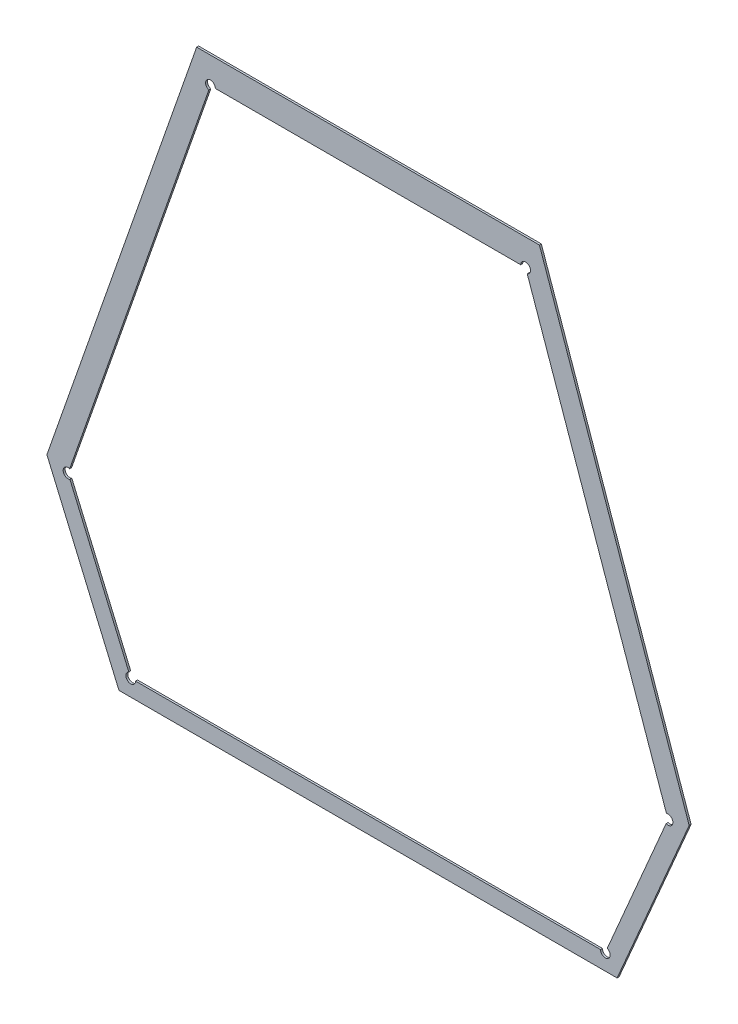
ISO-10303-21;
HEADER;
FILE_DESCRIPTION(('STEP AP214'),'2;1');
FILE_NAME('part.step','',(''),(''),'','','');
FILE_SCHEMA(('AUTOMOTIVE_DESIGN { 1 0 10303 214 1 1 1 1 }'));
ENDSEC;
DATA;
#1=APPLICATION_CONTEXT('core data for automotive mechanical design processes');
#2=APPLICATION_PROTOCOL_DEFINITION('international standard','automotive_design',2000,#1);
#3=PRODUCT_CONTEXT('',#1,'mechanical');
#4=PRODUCT('Part','Part','',(#3));
#5=PRODUCT_RELATED_PRODUCT_CATEGORY('part','',(#4));
#6=PRODUCT_DEFINITION_FORMATION('','',#4);
#7=PRODUCT_DEFINITION_CONTEXT('part definition',#1,'design');
#8=PRODUCT_DEFINITION('design','',#6,#7);
#9=PRODUCT_DEFINITION_SHAPE('','',#8);
#10=(LENGTH_UNIT() NAMED_UNIT(*) SI_UNIT(.MILLI.,.METRE.));
#11=(NAMED_UNIT(*) PLANE_ANGLE_UNIT() SI_UNIT($,.RADIAN.));
#12=(NAMED_UNIT(*) SI_UNIT($,.STERADIAN.) SOLID_ANGLE_UNIT());
#13=UNCERTAINTY_MEASURE_WITH_UNIT(LENGTH_MEASURE(1.E-05),#10,'distance_accuracy_value','');
#14=(GEOMETRIC_REPRESENTATION_CONTEXT(3) GLOBAL_UNCERTAINTY_ASSIGNED_CONTEXT((#13)) GLOBAL_UNIT_ASSIGNED_CONTEXT((#10,
#11,#12)) REPRESENTATION_CONTEXT('',''));
#15=CARTESIAN_POINT('',(0.,0.,0.));
#16=DIRECTION('',(0.,0.,1.));
#17=DIRECTION('',(1.,0.,0.));
#18=AXIS2_PLACEMENT_3D('',#15,#16,#17);
#19=CARTESIAN_POINT('',(-1.29399771700044,-1.37750986813174,0.002));
#20=DIRECTION('',(0.,0.,1.));
#21=DIRECTION('',(0.550494838754664,-0.8348385667328,0.));
#22=AXIS2_PLACEMENT_3D('',#19,#20,#21);
#23=CYLINDRICAL_SURFACE('',#22,0.00500000000000003);
#24=DIRECTION('',(0.,0.,1.));
#25=VECTOR('',#24,1.);
#26=CARTESIAN_POINT('',(-1.2920281626754,-1.37291412490995,0.));
#27=LINE('',#26,#25);
#28=CARTESIAN_POINT('',(-1.2920281626754,-1.37291412490995,0.));
#29=VERTEX_POINT('',#28);
#30=CARTESIAN_POINT('',(-1.2920281626754,-1.37291412490995,0.002));
#31=VERTEX_POINT('',#30);
#32=EDGE_CURVE('E11',#29,#31,#27,.T.);
#33=ORIENTED_EDGE('',*,*,#32,.F.);
#34=CARTESIAN_POINT('',(-1.29399771700044,-1.37750986813174,0.));
#35=DIRECTION('',(0.,0.,1.));
#36=DIRECTION('',(-1.,0.,0.));
#37=AXIS2_PLACEMENT_3D('',#34,#35,#36);
#38=CIRCLE('',#37,0.00500000000000003);
#39=CARTESIAN_POINT('',(-1.29899771700044,-1.37750986813174,0.));
#40=VERTEX_POINT('',#39);
#41=EDGE_CURVE('E297',#40,#29,#38,.T.);
#42=ORIENTED_EDGE('',*,*,#41,.F.);
#43=DIRECTION('',(0.,0.,-1.));
#44=VECTOR('',#43,1.);
#45=CARTESIAN_POINT('',(-1.29899771700044,-1.37750986813174,0.002));
#46=LINE('',#45,#44);
#47=CARTESIAN_POINT('',(-1.29899771700044,-1.37750986813174,0.002));
#48=VERTEX_POINT('',#47);
#49=EDGE_CURVE('E288',#48,#40,#46,.T.);
#50=ORIENTED_EDGE('',*,*,#49,.F.);
#51=CARTESIAN_POINT('',(-1.29399771700044,-1.37750986813174,0.002));
#52=DIRECTION('',(0.,0.,-1.));
#53=DIRECTION('',(0.393910865008706,0.919148644359601,0.));
#54=AXIS2_PLACEMENT_3D('',#51,#52,#53);
#55=CIRCLE('',#54,0.00500000000000003);
#56=EDGE_CURVE('E276',#31,#48,#55,.T.);
#57=ORIENTED_EDGE('',*,*,#56,.F.);
#58=EDGE_LOOP('',(#33,#42,#50,#57));
#59=FACE_BOUND('',#58,.T.);
#60=ADVANCED_FACE('F17',(#59),#23,.F.);
#61=CARTESIAN_POINT('',(-1.84866705041206,-1.2265091946304,0.002));
#62=DIRECTION('',(0.,0.,1.));
#63=DIRECTION('',(-1.,0.,0.));
#64=AXIS2_PLACEMENT_3D('',#61,#62,#63);
#65=CYLINDRICAL_SURFACE('',#64,0.00499999999999994);
#66=DIRECTION('',(0.,0.,-1.));
#67=VECTOR('',#66,1.);
#68=CARTESIAN_POINT('',(-1.84701507313068,-1.22178998165981,0.002));
#69=LINE('',#68,#67);
#70=CARTESIAN_POINT('',(-1.84701507313068,-1.22178998165981,0.002));
#71=VERTEX_POINT('',#70);
#72=CARTESIAN_POINT('',(-1.84701507313068,-1.22178998165981,0.));
#73=VERTEX_POINT('',#72);
#74=EDGE_CURVE('E24',#71,#73,#69,.T.);
#75=ORIENTED_EDGE('',*,*,#74,.F.);
#76=CARTESIAN_POINT('',(-1.84866705041206,-1.2265091946304,0.002));
#77=DIRECTION('',(0.,0.,-1.));
#78=DIRECTION('',(0.393910865007956,-0.919148644359923,0.));
#79=AXIS2_PLACEMENT_3D('',#76,#77,#78);
#80=CIRCLE('',#79,0.00499999999999994);
#81=CARTESIAN_POINT('',(-1.84669749608702,-1.2311049378522,0.002));
#82=VERTEX_POINT('',#81);
#83=EDGE_CURVE('E291',#82,#71,#80,.T.);
#84=ORIENTED_EDGE('',*,*,#83,.F.);
#85=DIRECTION('',(0.,0.,1.));
#86=VECTOR('',#85,1.);
#87=CARTESIAN_POINT('',(-1.84669749608702,-1.2311049378522,0.));
#88=LINE('',#87,#86);
#89=CARTESIAN_POINT('',(-1.84669749608702,-1.2311049378522,0.));
#90=VERTEX_POINT('',#89);
#91=EDGE_CURVE('E279',#90,#82,#88,.T.);
#92=ORIENTED_EDGE('',*,*,#91,.F.);
#93=CARTESIAN_POINT('',(-1.84866705041206,-1.2265091946304,0.));
#94=DIRECTION('',(0.,0.,1.));
#95=DIRECTION('',(0.330395456276158,0.943842594118357,0.));
#96=AXIS2_PLACEMENT_3D('',#93,#94,#95);
#97=CIRCLE('',#96,0.00499999999999994);
#98=EDGE_CURVE('E264',#73,#90,#97,.T.);
#99=ORIENTED_EDGE('',*,*,#98,.F.);
#100=EDGE_LOOP('',(#75,#84,#92,#99));
#101=FACE_BOUND('',#100,.T.);
#102=ADVANCED_FACE('F309',(#101),#65,.F.);
#103=CARTESIAN_POINT('',(-1.37630287528467,-0.806521766430921,0.002));
#104=DIRECTION('',(0.,0.,1.));
#105=DIRECTION('',(0.578621008831702,0.815596547404771,0.));
#106=AXIS2_PLACEMENT_3D('',#103,#104,#105);
#107=CYLINDRICAL_SURFACE('',#106,0.00500000000000005);
#108=DIRECTION('',(-1.11022302462516E-13,0.,1.));
#109=VECTOR('',#108,1.);
#110=CARTESIAN_POINT('',(-1.38130287528466,-0.806521766430921,0.));
#111=LINE('',#110,#109);
#112=CARTESIAN_POINT('',(-1.38130287528466,-0.806521766430921,0.));
#113=VERTEX_POINT('',#112);
#114=CARTESIAN_POINT('',(-1.38130287528466,-0.806521766430921,0.002));
#115=VERTEX_POINT('',#114);
#116=EDGE_CURVE('E294',#113,#115,#111,.T.);
#117=ORIENTED_EDGE('',*,*,#116,.F.);
#118=CARTESIAN_POINT('',(-1.37630287528467,-0.806521766430921,0.));
#119=DIRECTION('',(0.,0.,1.));
#120=DIRECTION('',(0.330395456277888,-0.943842594117751,0.));
#121=AXIS2_PLACEMENT_3D('',#118,#119,#120);
#122=CIRCLE('',#121,0.00500000000000005);
#123=CARTESIAN_POINT('',(-1.37465089800328,-0.811240979401511,0.));
#124=VERTEX_POINT('',#123);
#125=EDGE_CURVE('E282',#124,#113,#122,.T.);
#126=ORIENTED_EDGE('',*,*,#125,.F.);
#127=DIRECTION('',(0.,0.,-1.));
#128=VECTOR('',#127,1.);
#129=CARTESIAN_POINT('',(-1.37465089800328,-0.811240979401511,0.002));
#130=LINE('',#129,#128);
#131=CARTESIAN_POINT('',(-1.37465089800328,-0.811240979401511,0.002));
#132=VERTEX_POINT('',#131);
#133=EDGE_CURVE('E267',#132,#124,#130,.T.);
#134=ORIENTED_EDGE('',*,*,#133,.F.);
#135=CARTESIAN_POINT('',(-1.37630287528467,-0.806521766430921,0.002));
#136=DIRECTION('',(0.,0.,-1.));
#137=DIRECTION('',(-1.,0.,0.));
#138=AXIS2_PLACEMENT_3D('',#135,#136,#137);
#139=CIRCLE('',#138,0.00500000000000005);
#140=EDGE_CURVE('E252',#115,#132,#139,.T.);
#141=ORIENTED_EDGE('',*,*,#140,.F.);
#142=EDGE_LOOP('',(#117,#126,#134,#141));
#143=FACE_BOUND('',#142,.T.);
#144=ADVANCED_FACE('F330',(#143),#107,.F.);
#145=CARTESIAN_POINT('',(-1.7016489577392,-0.806521766430921,0.002));
#146=DIRECTION('',(0.,0.,1.));
#147=DIRECTION('',(-1.,0.,0.));
#148=AXIS2_PLACEMENT_3D('',#145,#146,#147);
#149=CYLINDRICAL_SURFACE('',#148,0.00500000000000006);
#150=DIRECTION('',(-1.11022302462516E-13,0.,-1.));
#151=VECTOR('',#150,1.);
#152=CARTESIAN_POINT('',(-1.6966489577392,-0.806521766430921,0.002));
#153=LINE('',#152,#151);
#154=CARTESIAN_POINT('',(-1.6966489577392,-0.806521766430921,0.002));
#155=VERTEX_POINT('',#154);
#156=CARTESIAN_POINT('',(-1.6966489577392,-0.806521766430921,0.));
#157=VERTEX_POINT('',#156);
#158=EDGE_CURVE('E285',#155,#157,#153,.T.);
#159=ORIENTED_EDGE('',*,*,#158,.F.);
#160=CARTESIAN_POINT('',(-1.7016489577392,-0.806521766430921,0.002));
#161=DIRECTION('',(0.,0.,-1.));
#162=DIRECTION('',(-0.330395456276151,-0.943842594118359,0.));
#163=AXIS2_PLACEMENT_3D('',#160,#161,#162);
#164=CIRCLE('',#163,0.00500000000000006);
#165=CARTESIAN_POINT('',(-1.70330093502058,-0.811240979401511,0.002));
#166=VERTEX_POINT('',#165);
#167=EDGE_CURVE('E270',#166,#155,#164,.T.);
#168=ORIENTED_EDGE('',*,*,#167,.F.);
#169=DIRECTION('',(0.,0.,1.));
#170=VECTOR('',#169,1.);
#171=CARTESIAN_POINT('',(-1.70330093502058,-0.811240979401511,0.));
#172=LINE('',#171,#170);
#173=CARTESIAN_POINT('',(-1.70330093502058,-0.811240979401511,0.));
#174=VERTEX_POINT('',#173);
#175=EDGE_CURVE('E255',#174,#166,#172,.T.);
#176=ORIENTED_EDGE('',*,*,#175,.F.);
#177=CARTESIAN_POINT('',(-1.7016489577392,-0.806521766430921,0.));
#178=DIRECTION('',(0.,0.,1.));
#179=DIRECTION('',(1.,0.,0.));
#180=AXIS2_PLACEMENT_3D('',#177,#178,#179);
#181=CIRCLE('',#180,0.00500000000000006);
#182=EDGE_CURVE('E243',#157,#174,#181,.T.);
#183=ORIENTED_EDGE('',*,*,#182,.F.);
#184=EDGE_LOOP('',(#159,#168,#176,#183));
#185=FACE_BOUND('',#184,.T.);
#186=ADVANCED_FACE('F306',(#185),#149,.F.);
#187=CARTESIAN_POINT('',(-1.78395411602342,-1.37750986813174,0.002));
#188=DIRECTION('',(0.,0.,1.));
#189=DIRECTION('',(-1.,0.,0.));
#190=AXIS2_PLACEMENT_3D('',#187,#188,#189);
#191=CYLINDRICAL_SURFACE('',#190,0.00499999999999997);
#192=DIRECTION('',(0.,0.,1.));
#193=VECTOR('',#192,1.);
#194=CARTESIAN_POINT('',(-1.77895411602342,-1.37750986813174,0.));
#195=LINE('',#194,#193);
#196=CARTESIAN_POINT('',(-1.77895411602342,-1.37750986813174,0.));
#197=VERTEX_POINT('',#196);
#198=CARTESIAN_POINT('',(-1.77895411602342,-1.37750986813174,0.002));
#199=VERTEX_POINT('',#198);
#200=EDGE_CURVE('E273',#197,#199,#195,.T.);
#201=ORIENTED_EDGE('',*,*,#200,.F.);
#202=CARTESIAN_POINT('',(-1.78395411602342,-1.37750986813174,0.));
#203=DIRECTION('',(0.,0.,1.));
#204=DIRECTION('',(-0.393910865010389,0.91914864435888,0.));
#205=AXIS2_PLACEMENT_3D('',#202,#203,#204);
#206=CIRCLE('',#205,0.00499999999999997);
#207=CARTESIAN_POINT('',(-1.78592367034847,-1.37291412490995,0.));
#208=VERTEX_POINT('',#207);
#209=EDGE_CURVE('E258',#208,#197,#206,.T.);
#210=ORIENTED_EDGE('',*,*,#209,.F.);
#211=DIRECTION('',(0.,0.,-1.));
#212=VECTOR('',#211,1.);
#213=CARTESIAN_POINT('',(-1.78592367034847,-1.37291412490995,0.002));
#214=LINE('',#213,#212);
#215=CARTESIAN_POINT('',(-1.78592367034847,-1.37291412490995,0.002));
#216=VERTEX_POINT('',#215);
#217=EDGE_CURVE('E246',#216,#208,#214,.T.);
#218=ORIENTED_EDGE('',*,*,#217,.F.);
#219=CARTESIAN_POINT('',(-1.78395411602342,-1.37750986813174,0.002));
#220=DIRECTION('',(0.,0.,-1.));
#221=DIRECTION('',(1.,0.,0.));
#222=AXIS2_PLACEMENT_3D('',#219,#220,#221);
#223=CIRCLE('',#222,0.00499999999999997);
#224=EDGE_CURVE('E234',#199,#216,#223,.T.);
#225=ORIENTED_EDGE('',*,*,#224,.F.);
#226=EDGE_LOOP('',(#201,#210,#218,#225));
#227=FACE_BOUND('',#226,.T.);
#228=ADVANCED_FACE('F315',(#227),#191,.F.);
#229=CARTESIAN_POINT('',(-1.2292847826118,-1.2265091946304,0.002));
#230=DIRECTION('',(0.,0.,1.));
#231=DIRECTION('',(0.999419331624489,-0.0340734438420955,0.));
#232=AXIS2_PLACEMENT_3D('',#229,#230,#231);
#233=CYLINDRICAL_SURFACE('',#232,0.00499999999999999);
#234=DIRECTION('',(0.,0.,1.));
#235=VECTOR('',#234,1.);
#236=CARTESIAN_POINT('',(-1.23093675989319,-1.22178998165981,0.));
#237=LINE('',#236,#235);
#238=CARTESIAN_POINT('',(-1.23093675989319,-1.22178998165981,0.));
#239=VERTEX_POINT('',#238);
#240=CARTESIAN_POINT('',(-1.23093675989319,-1.22178998165981,0.002));
#241=VERTEX_POINT('',#240);
#242=EDGE_CURVE('E261',#239,#241,#237,.T.);
#243=ORIENTED_EDGE('',*,*,#242,.F.);
#244=CARTESIAN_POINT('',(-1.2292847826118,-1.2265091946304,0.));
#245=DIRECTION('',(0.,0.,1.));
#246=DIRECTION('',(-0.393910865007956,-0.919148644359923,0.));
#247=AXIS2_PLACEMENT_3D('',#244,#245,#246);
#248=CIRCLE('',#247,0.00499999999999999);
#249=CARTESIAN_POINT('',(-1.23125433693684,-1.2311049378522,0.));
#250=VERTEX_POINT('',#249);
#251=EDGE_CURVE('E249',#250,#239,#248,.T.);
#252=ORIENTED_EDGE('',*,*,#251,.F.);
#253=DIRECTION('',(0.,0.,-1.));
#254=VECTOR('',#253,1.);
#255=CARTESIAN_POINT('',(-1.23125433693684,-1.2311049378522,0.002));
#256=LINE('',#255,#254);
#257=CARTESIAN_POINT('',(-1.23125433693684,-1.2311049378522,0.002));
#258=VERTEX_POINT('',#257);
#259=EDGE_CURVE('E237',#258,#250,#256,.T.);
#260=ORIENTED_EDGE('',*,*,#259,.F.);
#261=CARTESIAN_POINT('',(-1.2292847826118,-1.2265091946304,0.002));
#262=DIRECTION('',(0.,0.,-1.));
#263=DIRECTION('',(-0.330395456277895,0.943842594117749,0.));
#264=AXIS2_PLACEMENT_3D('',#261,#262,#263);
#265=CIRCLE('',#264,0.00499999999999999);
#266=EDGE_CURVE('E226',#241,#258,#265,.T.);
#267=ORIENTED_EDGE('',*,*,#266,.F.);
#268=EDGE_LOOP('',(#243,#252,#260,#267));
#269=FACE_BOUND('',#268,.T.);
#270=ADVANCED_FACE('F324',(#269),#233,.F.);
#271=CARTESIAN_POINT('',(-1.84866705041206,-1.2265091946304,0.));
#272=DIRECTION('',(-0.919148644359501,-0.393910865008941,0.));
#273=DIRECTION('',(0.393910865008941,-0.919148644359501,0.));
#274=AXIS2_PLACEMENT_3D('',#271,#272,#273);
#275=PLANE('',#274);
#276=ORIENTED_EDGE('',*,*,#91,.T.);
#277=DIRECTION('',(0.393910865008943,-0.9191486443595,0.));
#278=VECTOR('',#277,1.);
#279=CARTESIAN_POINT('',(-1.84669749608702,-1.2311049378522,0.002));
#280=LINE('',#279,#278);
#281=EDGE_CURVE('E240',#82,#216,#280,.T.);
#282=ORIENTED_EDGE('',*,*,#281,.T.);
#283=ORIENTED_EDGE('',*,*,#217,.T.);
#284=DIRECTION('',(0.393910865008943,-0.9191486443595,0.));
#285=VECTOR('',#284,1.);
#286=CARTESIAN_POINT('',(-1.84669749608702,-1.2311049378522,0.));
#287=LINE('',#286,#285);
#288=EDGE_CURVE('E220',#90,#208,#287,.T.);
#289=ORIENTED_EDGE('',*,*,#288,.F.);
#290=EDGE_LOOP('',(#276,#282,#283,#289));
#291=FACE_BOUND('',#290,.T.);
#292=ADVANCED_FACE('F312',(#291),#275,.F.);
#293=CARTESIAN_POINT('',(-1.29399771700044,-1.37750986813174,0.));
#294=DIRECTION('',(0.,1.,0.));
#295=DIRECTION('',(-1.,0.,0.));
#296=AXIS2_PLACEMENT_3D('',#293,#294,#295);
#297=PLANE('',#296);
#298=ORIENTED_EDGE('',*,*,#49,.T.);
#299=DIRECTION('',(-1.,0.,0.));
#300=VECTOR('',#299,1.);
#301=CARTESIAN_POINT('',(-1.29899771700044,-1.37750986813174,0.));
#302=LINE('',#301,#300);
#303=EDGE_CURVE('E229',#40,#197,#302,.T.);
#304=ORIENTED_EDGE('',*,*,#303,.T.);
#305=ORIENTED_EDGE('',*,*,#200,.T.);
#306=DIRECTION('',(-1.,0.,0.));
#307=VECTOR('',#306,1.);
#308=CARTESIAN_POINT('',(-1.29899771700044,-1.37750986813174,0.002));
#309=LINE('',#308,#307);
#310=EDGE_CURVE('E206',#48,#199,#309,.T.);
#311=ORIENTED_EDGE('',*,*,#310,.F.);
#312=EDGE_LOOP('',(#298,#304,#305,#311));
#313=FACE_BOUND('',#312,.T.);
#314=ADVANCED_FACE('F318',(#313),#297,.T.);
#315=CARTESIAN_POINT('',(-1.34513651296313,-1.11120173027947,0.));
#316=DIRECTION('',(0.,0.,1.));
#317=DIRECTION('',(1.,0.,0.));
#318=AXIS2_PLACEMENT_3D('',#315,#316,#317);
#319=PLANE('',#318);
#320=DIRECTION('',(-1.,0.,0.));
#321=VECTOR('',#320,1.);
#322=CARTESIAN_POINT('',(-1.36206782499118,-0.779218915312937,0.));
#323=LINE('',#322,#321);
#324=CARTESIAN_POINT('',(-1.36206782499118,-0.779218915312937,0.));
#325=VERTEX_POINT('',#324);
#326=CARTESIAN_POINT('',(-1.71588400803268,-0.779218915312937,0.));
#327=VERTEX_POINT('',#326);
#328=EDGE_CURVE('E232',#325,#327,#323,.T.);
#329=ORIENTED_EDGE('',*,*,#328,.F.);
#330=DIRECTION('',(-0.33039545627716,0.943842594118006,0.));
#331=VECTOR('',#330,1.);
#332=CARTESIAN_POINT('',(-1.20747378900398,-1.22084858421168,0.));
#333=LINE('',#332,#331);
#334=CARTESIAN_POINT('',(-1.20747378900398,-1.22084858421168,0.));
#335=VERTEX_POINT('',#334);
#336=EDGE_CURVE('E223',#335,#325,#333,.T.);
#337=ORIENTED_EDGE('',*,*,#336,.F.);
#338=DIRECTION('',(0.393910865008942,0.9191486443595,0.));
#339=VECTOR('',#338,1.);
#340=CARTESIAN_POINT('',(-1.28185234958468,-1.39440295704068,0.));
#341=LINE('',#340,#339);
#342=CARTESIAN_POINT('',(-1.28185234958468,-1.39440295704068,0.));
#343=VERTEX_POINT('',#342);
#344=EDGE_CURVE('E212',#343,#335,#341,.T.);
#345=ORIENTED_EDGE('',*,*,#344,.F.);
#346=DIRECTION('',(-1.,0.,0.));
#347=VECTOR('',#346,1.);
#348=CARTESIAN_POINT('',(-1.28185234958468,-1.39440295704068,0.));
#349=LINE('',#348,#347);
#350=CARTESIAN_POINT('',(-1.79609948343919,-1.39440295704068,0.));
#351=VERTEX_POINT('',#350);
#352=EDGE_CURVE('E147',#343,#351,#349,.T.);
#353=ORIENTED_EDGE('',*,*,#352,.T.);
#354=DIRECTION('',(-0.39391086500894,0.919148644359501,0.));
#355=VECTOR('',#354,1.);
#356=CARTESIAN_POINT('',(-1.79609948343919,-1.39440295704068,0.));
#357=LINE('',#356,#355);
#358=CARTESIAN_POINT('',(-1.87047804401988,-1.22084858421168,0.));
#359=VERTEX_POINT('',#358);
#360=EDGE_CURVE('E203',#351,#359,#357,.T.);
#361=ORIENTED_EDGE('',*,*,#360,.T.);
#362=DIRECTION('',(0.33039545627716,0.943842594118006,0.));
#363=VECTOR('',#362,1.);
#364=CARTESIAN_POINT('',(-1.87047804401988,-1.22084858421168,0.));
#365=LINE('',#364,#363);
#366=EDGE_CURVE('E217',#359,#327,#365,.T.);
#367=ORIENTED_EDGE('',*,*,#366,.T.);
#368=EDGE_LOOP('',(#329,#337,#345,#353,#361,#367));
#369=FACE_BOUND('',#368,.T.);
#370=ORIENTED_EDGE('',*,*,#41,.T.);
#371=DIRECTION('',(-0.393910865008942,-0.9191486443595,0.));
#372=VECTOR('',#371,1.);
#373=CARTESIAN_POINT('',(-1.23125433693684,-1.2311049378522,0.));
#374=LINE('',#373,#372);
#375=EDGE_CURVE('E209',#250,#29,#374,.T.);
#376=ORIENTED_EDGE('',*,*,#375,.F.);
#377=ORIENTED_EDGE('',*,*,#251,.T.);
#378=DIRECTION('',(0.33039545627716,-0.943842594118006,0.));
#379=VECTOR('',#378,1.);
#380=CARTESIAN_POINT('',(-1.37465089800328,-0.811240979401512,0.));
#381=LINE('',#380,#379);
#382=EDGE_CURVE('E214',#124,#239,#381,.T.);
#383=ORIENTED_EDGE('',*,*,#382,.F.);
#384=ORIENTED_EDGE('',*,*,#125,.T.);
#385=DIRECTION('',(1.,0.,0.));
#386=VECTOR('',#385,1.);
#387=CARTESIAN_POINT('',(-1.6966489577392,-0.806521766430921,0.));
#388=LINE('',#387,#386);
#389=EDGE_CURVE('E183',#157,#113,#388,.T.);
#390=ORIENTED_EDGE('',*,*,#389,.F.);
#391=ORIENTED_EDGE('',*,*,#182,.T.);
#392=DIRECTION('',(-0.330395456277161,-0.943842594118006,0.));
#393=VECTOR('',#392,1.);
#394=CARTESIAN_POINT('',(-1.70330093502059,-0.811240979401509,0.));
#395=LINE('',#394,#393);
#396=EDGE_CURVE('E190',#174,#73,#395,.T.);
#397=ORIENTED_EDGE('',*,*,#396,.T.);
#398=ORIENTED_EDGE('',*,*,#98,.T.);
#399=ORIENTED_EDGE('',*,*,#288,.T.);
#400=ORIENTED_EDGE('',*,*,#209,.T.);
#401=ORIENTED_EDGE('',*,*,#303,.F.);
#402=EDGE_LOOP('',(#370,#376,#377,#383,#384,#390,#391,#397,#398,#399,#400,#401));
#403=FACE_BOUND('',#402,.T.);
#404=ADVANCED_FACE('F303',(#369,#403),#319,.F.);
#405=CARTESIAN_POINT('',(-1.37630287528467,-0.806521766430921,0.));
#406=DIRECTION('',(-0.943842594118006,-0.330395456277161,0.));
#407=DIRECTION('',(0.330395456277161,-0.943842594118006,0.));
#408=AXIS2_PLACEMENT_3D('',#405,#406,#407);
#409=PLANE('',#408);
#410=ORIENTED_EDGE('',*,*,#133,.T.);
#411=ORIENTED_EDGE('',*,*,#382,.T.);
#412=ORIENTED_EDGE('',*,*,#242,.T.);
#413=DIRECTION('',(0.33039545627716,-0.943842594118006,0.));
#414=VECTOR('',#413,1.);
#415=CARTESIAN_POINT('',(-1.37465089800328,-0.811240979401512,0.002));
#416=LINE('',#415,#414);
#417=EDGE_CURVE('E193',#132,#241,#416,.T.);
#418=ORIENTED_EDGE('',*,*,#417,.F.);
#419=EDGE_LOOP('',(#410,#411,#412,#418));
#420=FACE_BOUND('',#419,.T.);
#421=ADVANCED_FACE('F327',(#420),#409,.T.);
#422=CARTESIAN_POINT('',(-1.87047804401988,-1.22084858421168,0.));
#423=DIRECTION('',(0.943842594118006,-0.33039545627716,0.));
#424=DIRECTION('',(0.33039545627716,0.943842594118006,0.));
#425=AXIS2_PLACEMENT_3D('',#422,#423,#424);
#426=PLANE('',#425);
#427=ORIENTED_EDGE('',*,*,#366,.F.);
#428=DIRECTION('',(-1.11022302462516E-13,0.,1.));
#429=VECTOR('',#428,1.);
#430=CARTESIAN_POINT('',(-1.87047804401988,-1.22084858421168,0.));
#431=LINE('',#430,#429);
#432=CARTESIAN_POINT('',(-1.87047804401988,-1.22084858421168,0.002));
#433=VERTEX_POINT('',#432);
#434=EDGE_CURVE('E201',#359,#433,#431,.T.);
#435=ORIENTED_EDGE('',*,*,#434,.T.);
#436=DIRECTION('',(0.33039545627716,0.943842594118006,0.));
#437=VECTOR('',#436,1.);
#438=CARTESIAN_POINT('',(-1.87047804401988,-1.22084858421168,0.002));
#439=LINE('',#438,#437);
#440=CARTESIAN_POINT('',(-1.71588400803268,-0.779218915312937,0.002));
#441=VERTEX_POINT('',#440);
#442=EDGE_CURVE('E196',#433,#441,#439,.T.);
#443=ORIENTED_EDGE('',*,*,#442,.T.);
#444=DIRECTION('',(0.,0.,1.));
#445=VECTOR('',#444,1.);
#446=CARTESIAN_POINT('',(-1.71588400803268,-0.779218915312937,0.));
#447=LINE('',#446,#445);
#448=EDGE_CURVE('E186',#327,#441,#447,.T.);
#449=ORIENTED_EDGE('',*,*,#448,.F.);
#450=EDGE_LOOP('',(#427,#435,#443,#449));
#451=FACE_BOUND('',#450,.T.);
#452=ADVANCED_FACE('F447',(#451),#426,.F.);
#453=CARTESIAN_POINT('',(-1.79609948343919,-1.39440295704068,0.));
#454=DIRECTION('',(0.919148644359501,0.393910865008941,0.));
#455=DIRECTION('',(-0.393910865008941,0.919148644359501,0.));
#456=AXIS2_PLACEMENT_3D('',#453,#454,#455);
#457=PLANE('',#456);
#458=ORIENTED_EDGE('',*,*,#360,.F.);
#459=DIRECTION('',(0.,-1.11022302462516E-13,1.));
#460=VECTOR('',#459,1.);
#461=CARTESIAN_POINT('',(-1.79609948343919,-1.39440295704068,0.));
#462=LINE('',#461,#460);
#463=CARTESIAN_POINT('',(-1.79609948343919,-1.39440295704068,0.002));
#464=VERTEX_POINT('',#463);
#465=EDGE_CURVE('E198',#351,#464,#462,.T.);
#466=ORIENTED_EDGE('',*,*,#465,.T.);
#467=DIRECTION('',(-0.39391086500894,0.919148644359501,0.));
#468=VECTOR('',#467,1.);
#469=CARTESIAN_POINT('',(-1.79609948343919,-1.39440295704068,0.002));
#470=LINE('',#469,#468);
#471=EDGE_CURVE('E167',#464,#433,#470,.T.);
#472=ORIENTED_EDGE('',*,*,#471,.T.);
#473=ORIENTED_EDGE('',*,*,#434,.F.);
#474=EDGE_LOOP('',(#458,#466,#472,#473));
#475=FACE_BOUND('',#474,.T.);
#476=ADVANCED_FACE('F355',(#475),#457,.F.);
#477=CARTESIAN_POINT('',(-1.7016489577392,-0.806521766430921,0.));
#478=DIRECTION('',(-0.943842594118006,0.330395456277161,0.));
#479=DIRECTION('',(-0.330395456277161,-0.943842594118006,0.));
#480=AXIS2_PLACEMENT_3D('',#477,#478,#479);
#481=PLANE('',#480);
#482=ORIENTED_EDGE('',*,*,#74,.T.);
#483=ORIENTED_EDGE('',*,*,#396,.F.);
#484=ORIENTED_EDGE('',*,*,#175,.T.);
#485=DIRECTION('',(-0.330395456277161,-0.943842594118006,0.));
#486=VECTOR('',#485,1.);
#487=CARTESIAN_POINT('',(-1.70330093502059,-0.811240979401509,0.002));
#488=LINE('',#487,#486);
#489=EDGE_CURVE('E177',#166,#71,#488,.T.);
#490=ORIENTED_EDGE('',*,*,#489,.T.);
#491=EDGE_LOOP('',(#482,#483,#484,#490));
#492=FACE_BOUND('',#491,.T.);
#493=ADVANCED_FACE('F300',(#492),#481,.F.);
#494=CARTESIAN_POINT('',(-1.36206782499118,-0.779218915312937,0.));
#495=DIRECTION('',(0.,1.,0.));
#496=DIRECTION('',(-1.,0.,0.));
#497=AXIS2_PLACEMENT_3D('',#494,#495,#496);
#498=PLANE('',#497);
#499=ORIENTED_EDGE('',*,*,#328,.T.);
#500=ORIENTED_EDGE('',*,*,#448,.T.);
#501=DIRECTION('',(-1.,0.,0.));
#502=VECTOR('',#501,1.);
#503=CARTESIAN_POINT('',(-1.36206782499118,-0.779218915312937,0.002));
#504=LINE('',#503,#502);
#505=CARTESIAN_POINT('',(-1.36206782499118,-0.779218915312937,0.002));
#506=VERTEX_POINT('',#505);
#507=EDGE_CURVE('E179',#506,#441,#504,.T.);
#508=ORIENTED_EDGE('',*,*,#507,.F.);
#509=DIRECTION('',(0.,0.,1.));
#510=VECTOR('',#509,1.);
#511=CARTESIAN_POINT('',(-1.36206782499118,-0.779218915312937,0.));
#512=LINE('',#511,#510);
#513=EDGE_CURVE('E181',#325,#506,#512,.T.);
#514=ORIENTED_EDGE('',*,*,#513,.F.);
#515=EDGE_LOOP('',(#499,#500,#508,#514));
#516=FACE_BOUND('',#515,.T.);
#517=ADVANCED_FACE('F354',(#516),#498,.T.);
#518=CARTESIAN_POINT('',(-1.20747378900398,-1.22084858421168,0.));
#519=DIRECTION('',(0.943842594118006,0.33039545627716,0.));
#520=DIRECTION('',(-0.33039545627716,0.943842594118006,0.));
#521=AXIS2_PLACEMENT_3D('',#518,#519,#520);
#522=PLANE('',#521);
#523=ORIENTED_EDGE('',*,*,#336,.T.);
#524=ORIENTED_EDGE('',*,*,#513,.T.);
#525=DIRECTION('',(-0.33039545627716,0.943842594118006,0.));
#526=VECTOR('',#525,1.);
#527=CARTESIAN_POINT('',(-1.20747378900398,-1.22084858421168,0.002));
#528=LINE('',#527,#526);
#529=CARTESIAN_POINT('',(-1.20747378900398,-1.22084858421168,0.002));
#530=VERTEX_POINT('',#529);
#531=EDGE_CURVE('E150',#530,#506,#528,.T.);
#532=ORIENTED_EDGE('',*,*,#531,.F.);
#533=DIRECTION('',(-1.11022302462516E-13,0.,1.));
#534=VECTOR('',#533,1.);
#535=CARTESIAN_POINT('',(-1.20747378900398,-1.22084858421168,0.));
#536=LINE('',#535,#534);
#537=EDGE_CURVE('E156',#335,#530,#536,.T.);
#538=ORIENTED_EDGE('',*,*,#537,.F.);
#539=EDGE_LOOP('',(#523,#524,#532,#538));
#540=FACE_BOUND('',#539,.T.);
#541=ADVANCED_FACE('F480',(#540),#522,.T.);
#542=CARTESIAN_POINT('',(-1.28185234958468,-1.39440295704068,0.));
#543=DIRECTION('',(0.919148644359501,-0.393910865008941,0.));
#544=DIRECTION('',(0.393910865008941,0.919148644359501,0.));
#545=AXIS2_PLACEMENT_3D('',#542,#543,#544);
#546=PLANE('',#545);
#547=ORIENTED_EDGE('',*,*,#344,.T.);
#548=ORIENTED_EDGE('',*,*,#537,.T.);
#549=DIRECTION('',(0.393910865008942,0.9191486443595,0.));
#550=VECTOR('',#549,1.);
#551=CARTESIAN_POINT('',(-1.28185234958468,-1.39440295704068,0.002));
#552=LINE('',#551,#550);
#553=CARTESIAN_POINT('',(-1.28185234958468,-1.39440295704068,0.002));
#554=VERTEX_POINT('',#553);
#555=EDGE_CURVE('E151',#554,#530,#552,.T.);
#556=ORIENTED_EDGE('',*,*,#555,.F.);
#557=DIRECTION('',(0.,-1.11022302462516E-13,1.));
#558=VECTOR('',#557,1.);
#559=CARTESIAN_POINT('',(-1.28185234958468,-1.39440295704068,0.));
#560=LINE('',#559,#558);
#561=EDGE_CURVE('E139',#343,#554,#560,.T.);
#562=ORIENTED_EDGE('',*,*,#561,.F.);
#563=EDGE_LOOP('',(#547,#548,#556,#562));
#564=FACE_BOUND('',#563,.T.);
#565=ADVANCED_FACE('F154',(#564),#546,.T.);
#566=CARTESIAN_POINT('',(-1.53897591651193,-1.39440295704068,0.));
#567=DIRECTION('',(0.,-1.,0.));
#568=DIRECTION('',(1.,0.,0.));
#569=AXIS2_PLACEMENT_3D('',#566,#567,#568);
#570=PLANE('',#569);
#571=ORIENTED_EDGE('',*,*,#352,.F.);
#572=ORIENTED_EDGE('',*,*,#561,.T.);
#573=DIRECTION('',(-1.,0.,0.));
#574=VECTOR('',#573,1.);
#575=CARTESIAN_POINT('',(-1.28185234958468,-1.39440295704068,0.002));
#576=LINE('',#575,#574);
#577=EDGE_CURVE('E144',#554,#464,#576,.T.);
#578=ORIENTED_EDGE('',*,*,#577,.T.);
#579=ORIENTED_EDGE('',*,*,#465,.F.);
#580=EDGE_LOOP('',(#571,#572,#578,#579));
#581=FACE_BOUND('',#580,.T.);
#582=ADVANCED_FACE('F141',(#581),#570,.T.);
#583=CARTESIAN_POINT('',(-1.2292847826118,-1.2265091946304,0.));
#584=DIRECTION('',(-0.919148644359501,0.393910865008941,0.));
#585=DIRECTION('',(-0.393910865008941,-0.919148644359501,0.));
#586=AXIS2_PLACEMENT_3D('',#583,#584,#585);
#587=PLANE('',#586);
#588=ORIENTED_EDGE('',*,*,#32,.T.);
#589=DIRECTION('',(-0.393910865008942,-0.9191486443595,0.));
#590=VECTOR('',#589,1.);
#591=CARTESIAN_POINT('',(-1.23125433693684,-1.2311049378522,0.002));
#592=LINE('',#591,#590);
#593=EDGE_CURVE('E160',#258,#31,#592,.T.);
#594=ORIENTED_EDGE('',*,*,#593,.F.);
#595=ORIENTED_EDGE('',*,*,#259,.T.);
#596=ORIENTED_EDGE('',*,*,#375,.T.);
#597=EDGE_LOOP('',(#588,#594,#595,#596));
#598=FACE_BOUND('',#597,.T.);
#599=ADVANCED_FACE('F321',(#598),#587,.T.);
#600=CARTESIAN_POINT('',(-1.53897591651193,-0.806521766430921,0.));
#601=DIRECTION('',(0.,-1.,0.));
#602=DIRECTION('',(1.,0.,0.));
#603=AXIS2_PLACEMENT_3D('',#600,#601,#602);
#604=PLANE('',#603);
#605=ORIENTED_EDGE('',*,*,#116,.T.);
#606=DIRECTION('',(-1.,0.,0.));
#607=VECTOR('',#606,1.);
#608=CARTESIAN_POINT('',(-1.38130287528466,-0.806521766430921,0.002));
#609=LINE('',#608,#607);
#610=EDGE_CURVE('E168',#115,#155,#609,.T.);
#611=ORIENTED_EDGE('',*,*,#610,.T.);
#612=ORIENTED_EDGE('',*,*,#158,.T.);
#613=ORIENTED_EDGE('',*,*,#389,.T.);
#614=EDGE_LOOP('',(#605,#611,#612,#613));
#615=FACE_BOUND('',#614,.T.);
#616=ADVANCED_FACE('F332',(#615),#604,.T.);
#617=CARTESIAN_POINT('',(-1.34513651296313,-1.11120173027947,0.002));
#618=DIRECTION('',(0.,0.,1.));
#619=DIRECTION('',(1.,0.,0.));
#620=AXIS2_PLACEMENT_3D('',#617,#618,#619);
#621=PLANE('',#620);
#622=ORIENTED_EDGE('',*,*,#507,.T.);
#623=ORIENTED_EDGE('',*,*,#442,.F.);
#624=ORIENTED_EDGE('',*,*,#471,.F.);
#625=ORIENTED_EDGE('',*,*,#577,.F.);
#626=ORIENTED_EDGE('',*,*,#555,.T.);
#627=ORIENTED_EDGE('',*,*,#531,.T.);
#628=EDGE_LOOP('',(#622,#623,#624,#625,#626,#627));
#629=FACE_BOUND('',#628,.T.);
#630=ORIENTED_EDGE('',*,*,#56,.T.);
#631=ORIENTED_EDGE('',*,*,#310,.T.);
#632=ORIENTED_EDGE('',*,*,#224,.T.);
#633=ORIENTED_EDGE('',*,*,#281,.F.);
#634=ORIENTED_EDGE('',*,*,#83,.T.);
#635=ORIENTED_EDGE('',*,*,#489,.F.);
#636=ORIENTED_EDGE('',*,*,#167,.T.);
#637=ORIENTED_EDGE('',*,*,#610,.F.);
#638=ORIENTED_EDGE('',*,*,#140,.T.);
#639=ORIENTED_EDGE('',*,*,#417,.T.);
#640=ORIENTED_EDGE('',*,*,#266,.T.);
#641=ORIENTED_EDGE('',*,*,#593,.T.);
#642=EDGE_LOOP('',(#630,#631,#632,#633,#634,#635,#636,#637,#638,#639,#640,#641));
#643=FACE_BOUND('',#642,.T.);
#644=ADVANCED_FACE('F163',(#629,#643),#621,.T.);
#645=CLOSED_SHELL('',(#60,#102,#144,#186,#228,#270,#292,#314,#404,#421,#452,#476,#493,#517,#541,
#565,#582,#599,#616,#644));
#646=MANIFOLD_SOLID_BREP('B1',#645);
#647=ADVANCED_BREP_SHAPE_REPRESENTATION('',(#18,#646),#14);
#648=SHAPE_DEFINITION_REPRESENTATION(#9,#647);
ENDSEC;
END-ISO-10303-21;
